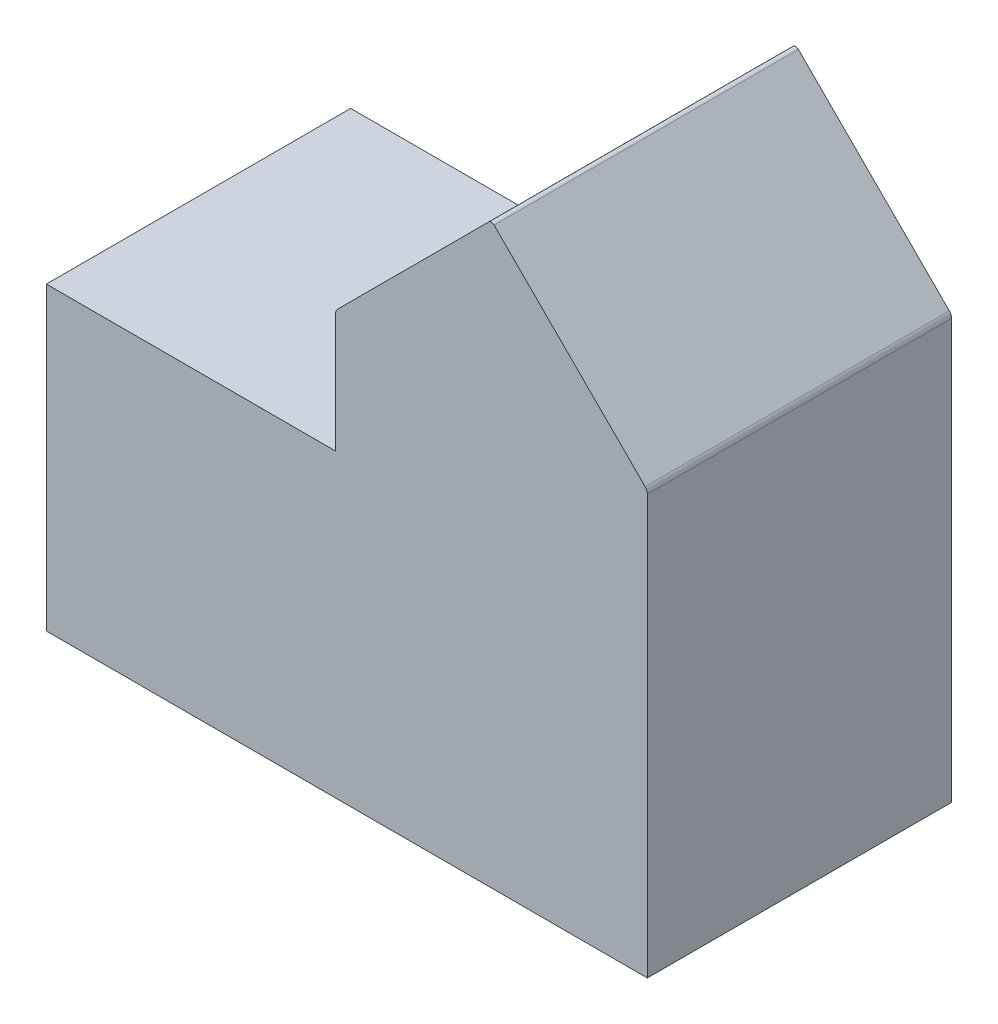
ISO-10303-21;
HEADER;
FILE_DESCRIPTION(('STEP AP214'),'2;1');
FILE_NAME('part.step','',(''),(''),'','','');
FILE_SCHEMA(('AUTOMOTIVE_DESIGN { 1 0 10303 214 1 1 1 1 }'));
ENDSEC;
DATA;
#1=APPLICATION_CONTEXT('core data for automotive mechanical design processes');
#2=APPLICATION_PROTOCOL_DEFINITION('international standard','automotive_design',2000,#1);
#3=PRODUCT_CONTEXT('',#1,'mechanical');
#4=PRODUCT('Part','Part','',(#3));
#5=PRODUCT_RELATED_PRODUCT_CATEGORY('part','',(#4));
#6=PRODUCT_DEFINITION_FORMATION('','',#4);
#7=PRODUCT_DEFINITION_CONTEXT('part definition',#1,'design');
#8=PRODUCT_DEFINITION('design','',#6,#7);
#9=PRODUCT_DEFINITION_SHAPE('','',#8);
#10=(LENGTH_UNIT() NAMED_UNIT(*) SI_UNIT(.MILLI.,.METRE.));
#11=(NAMED_UNIT(*) PLANE_ANGLE_UNIT() SI_UNIT($,.RADIAN.));
#12=(NAMED_UNIT(*) SI_UNIT($,.STERADIAN.) SOLID_ANGLE_UNIT());
#13=UNCERTAINTY_MEASURE_WITH_UNIT(LENGTH_MEASURE(1.E-05),#10,'distance_accuracy_value','');
#14=(GEOMETRIC_REPRESENTATION_CONTEXT(3) GLOBAL_UNCERTAINTY_ASSIGNED_CONTEXT((#13)) GLOBAL_UNIT_ASSIGNED_CONTEXT((#10,
#11,#12)) REPRESENTATION_CONTEXT('',''));
#15=CARTESIAN_POINT('',(0.,0.,0.));
#16=DIRECTION('',(0.,0.,1.));
#17=DIRECTION('',(1.,0.,0.));
#18=AXIS2_PLACEMENT_3D('',#15,#16,#17);
#19=CARTESIAN_POINT('',(-4.73075,4.73074999999998,5.08));
#20=DIRECTION('',(0.707106781186549,-0.707106781186546,0.));
#21=DIRECTION('',(0.707106781186546,0.707106781186549,0.));
#22=AXIS2_PLACEMENT_3D('',#19,#20,#21);
#23=PLANE('',#22);
#24=DIRECTION('',(-0.707106781186546,-0.707106781186549,0.));
#25=VECTOR('',#24,1.);
#26=CARTESIAN_POINT('',(-4.73075,4.73074999999998,5.08));
#27=LINE('',#26,#25);
#28=CARTESIAN_POINT('',(4.73619743878929,14.1976974387893,5.08));
#29=VERTEX_POINT('',#28);
#30=CARTESIAN_POINT('',(-0.306605122421382,9.15489487757861,5.08));
#31=VERTEX_POINT('',#30);
#32=EDGE_CURVE('E132',#29,#31,#27,.T.);
#33=ORIENTED_EDGE('',*,*,#32,.F.);
#34=DIRECTION('',(0.,0.,-1.));
#35=VECTOR('',#34,1.);
#36=CARTESIAN_POINT('',(4.73619743878929,14.1976974387893,5.08));
#37=LINE('',#36,#35);
#38=CARTESIAN_POINT('',(4.73619743878929,14.1976974387893,-5.08));
#39=VERTEX_POINT('',#38);
#40=EDGE_CURVE('E220',#29,#39,#37,.T.);
#41=ORIENTED_EDGE('',*,*,#40,.T.);
#42=DIRECTION('',(-0.707106781186546,-0.707106781186549,0.));
#43=VECTOR('',#42,1.);
#44=CARTESIAN_POINT('',(-4.73075,4.73074999999998,-5.08));
#45=LINE('',#44,#43);
#46=CARTESIAN_POINT('',(-0.306605122421382,9.15489487757861,-5.08));
#47=VERTEX_POINT('',#46);
#48=EDGE_CURVE('E165',#39,#47,#45,.T.);
#49=ORIENTED_EDGE('',*,*,#48,.T.);
#50=DIRECTION('',(0.,0.,-1.));
#51=VECTOR('',#50,1.);
#52=CARTESIAN_POINT('',(-0.306605122421382,9.15489487757861,5.08));
#53=LINE('',#52,#51);
#54=EDGE_CURVE('E204',#47,#31,#53,.F.);
#55=ORIENTED_EDGE('',*,*,#54,.T.);
#56=EDGE_LOOP('',(#33,#41,#49,#55));
#57=FACE_BOUND('',#56,.T.);
#58=ADVANCED_FACE('F41',(#57),#23,.F.);
#59=CARTESIAN_POINT('',(-0.380999999999999,0.,5.08));
#60=DIRECTION('',(1.,0.,0.));
#61=DIRECTION('',(0.,0.,-1.));
#62=AXIS2_PLACEMENT_3D('',#59,#60,#61);
#63=PLANE('',#62);
#64=DIRECTION('',(0.,-1.,0.));
#65=VECTOR('',#64,1.);
#66=CARTESIAN_POINT('',(-0.380999999999999,0.,5.08));
#67=LINE('',#66,#65);
#68=CARTESIAN_POINT('',(-0.380999999999999,8.97528975515723,5.08));
#69=VERTEX_POINT('',#68);
#70=CARTESIAN_POINT('',(-0.380999999999999,5.0165,5.08));
#71=VERTEX_POINT('',#70);
#72=EDGE_CURVE('E119',#69,#71,#67,.T.);
#73=ORIENTED_EDGE('',*,*,#72,.F.);
#74=DIRECTION('',(0.,0.,-1.));
#75=VECTOR('',#74,1.);
#76=CARTESIAN_POINT('',(-0.380999999999999,8.97528975515723,5.08));
#77=LINE('',#76,#75);
#78=CARTESIAN_POINT('',(-0.380999999999999,8.97528975515723,-5.08));
#79=VERTEX_POINT('',#78);
#80=EDGE_CURVE('E143',#69,#79,#77,.T.);
#81=ORIENTED_EDGE('',*,*,#80,.T.);
#82=DIRECTION('',(0.,-1.,0.));
#83=VECTOR('',#82,1.);
#84=CARTESIAN_POINT('',(-0.380999999999999,0.,-5.08));
#85=LINE('',#84,#83);
#86=CARTESIAN_POINT('',(-0.380999999999999,5.0165,-5.08));
#87=VERTEX_POINT('',#86);
#88=EDGE_CURVE('E138',#79,#87,#85,.T.);
#89=ORIENTED_EDGE('',*,*,#88,.T.);
#90=DIRECTION('',(0.,0.,-1.));
#91=VECTOR('',#90,1.);
#92=CARTESIAN_POINT('',(-0.380999999999999,5.0165,5.08));
#93=LINE('',#92,#91);
#94=EDGE_CURVE('E135',#71,#87,#93,.T.);
#95=ORIENTED_EDGE('',*,*,#94,.F.);
#96=EDGE_LOOP('',(#73,#81,#89,#95));
#97=FACE_BOUND('',#96,.T.);
#98=ADVANCED_FACE('F136',(#97),#63,.F.);
#99=CARTESIAN_POINT('',(0.,5.0165,5.08));
#100=DIRECTION('',(0.,1.,0.));
#101=DIRECTION('',(0.,0.,1.));
#102=AXIS2_PLACEMENT_3D('',#99,#100,#101);
#103=PLANE('',#102);
#104=DIRECTION('',(1.,0.,0.));
#105=VECTOR('',#104,1.);
#106=CARTESIAN_POINT('',(0.,5.0165,-5.08));
#107=LINE('',#106,#105);
#108=CARTESIAN_POINT('',(-10.033,5.0165,-5.08));
#109=VERTEX_POINT('',#108);
#110=EDGE_CURVE('E170',#109,#87,#107,.T.);
#111=ORIENTED_EDGE('',*,*,#110,.F.);
#112=DIRECTION('',(0.,0.,-1.));
#113=VECTOR('',#112,1.);
#114=CARTESIAN_POINT('',(-10.033,5.0165,5.08));
#115=LINE('',#114,#113);
#116=CARTESIAN_POINT('',(-10.033,5.0165,5.08));
#117=VERTEX_POINT('',#116);
#118=EDGE_CURVE('E144',#117,#109,#115,.T.);
#119=ORIENTED_EDGE('',*,*,#118,.F.);
#120=DIRECTION('',(1.,0.,0.));
#121=VECTOR('',#120,1.);
#122=CARTESIAN_POINT('',(0.,5.0165,5.08));
#123=LINE('',#122,#121);
#124=EDGE_CURVE('E124',#117,#71,#123,.T.);
#125=ORIENTED_EDGE('',*,*,#124,.T.);
#126=ORIENTED_EDGE('',*,*,#94,.T.);
#127=EDGE_LOOP('',(#111,#119,#125,#126));
#128=FACE_BOUND('',#127,.T.);
#129=ADVANCED_FACE('F146',(#128),#103,.T.);
#130=CARTESIAN_POINT('',(-10.033,0.,5.08));
#131=DIRECTION('',(-1.,0.,0.));
#132=DIRECTION('',(0.,0.,1.));
#133=AXIS2_PLACEMENT_3D('',#130,#131,#132);
#134=PLANE('',#133);
#135=DIRECTION('',(0.,1.,0.));
#136=VECTOR('',#135,1.);
#137=CARTESIAN_POINT('',(-10.033,0.,-5.08));
#138=LINE('',#137,#136);
#139=CARTESIAN_POINT('',(-10.033,-5.0165,-5.08));
#140=VERTEX_POINT('',#139);
#141=EDGE_CURVE('E173',#140,#109,#138,.T.);
#142=ORIENTED_EDGE('',*,*,#141,.F.);
#143=DIRECTION('',(0.,0.,-1.));
#144=VECTOR('',#143,1.);
#145=CARTESIAN_POINT('',(-10.033,-5.0165,5.08));
#146=LINE('',#145,#144);
#147=CARTESIAN_POINT('',(-10.033,-5.0165,5.08));
#148=VERTEX_POINT('',#147);
#149=EDGE_CURVE('E190',#148,#140,#146,.T.);
#150=ORIENTED_EDGE('',*,*,#149,.F.);
#151=DIRECTION('',(0.,1.,0.));
#152=VECTOR('',#151,1.);
#153=CARTESIAN_POINT('',(-10.033,0.,5.08));
#154=LINE('',#153,#152);
#155=EDGE_CURVE('E148',#148,#117,#154,.T.);
#156=ORIENTED_EDGE('',*,*,#155,.T.);
#157=ORIENTED_EDGE('',*,*,#118,.T.);
#158=EDGE_LOOP('',(#142,#150,#156,#157));
#159=FACE_BOUND('',#158,.T.);
#160=ADVANCED_FACE('F253',(#159),#134,.T.);
#161=CARTESIAN_POINT('',(0.,-5.0165,5.08));
#162=DIRECTION('',(0.,1.,0.));
#163=DIRECTION('',(0.,0.,1.));
#164=AXIS2_PLACEMENT_3D('',#161,#162,#163);
#165=PLANE('',#164);
#166=DIRECTION('',(1.,0.,0.));
#167=VECTOR('',#166,1.);
#168=CARTESIAN_POINT('',(0.,-5.0165,-5.08));
#169=LINE('',#168,#167);
#170=CARTESIAN_POINT('',(10.033,-5.0165,-5.08));
#171=VERTEX_POINT('',#170);
#172=EDGE_CURVE('E177',#140,#171,#169,.T.);
#173=ORIENTED_EDGE('',*,*,#172,.T.);
#174=DIRECTION('',(0.,0.,-1.));
#175=VECTOR('',#174,1.);
#176=CARTESIAN_POINT('',(10.033,-5.0165,5.08));
#177=LINE('',#176,#175);
#178=CARTESIAN_POINT('',(10.033,-5.0165,5.08));
#179=VERTEX_POINT('',#178);
#180=EDGE_CURVE('E164',#179,#171,#177,.T.);
#181=ORIENTED_EDGE('',*,*,#180,.F.);
#182=DIRECTION('',(1.,0.,0.));
#183=VECTOR('',#182,1.);
#184=CARTESIAN_POINT('',(0.,-5.0165,5.08));
#185=LINE('',#184,#183);
#186=EDGE_CURVE('E151',#148,#179,#185,.T.);
#187=ORIENTED_EDGE('',*,*,#186,.F.);
#188=ORIENTED_EDGE('',*,*,#149,.T.);
#189=EDGE_LOOP('',(#173,#181,#187,#188));
#190=FACE_BOUND('',#189,.T.);
#191=ADVANCED_FACE('F256',(#190),#165,.F.);
#192=CARTESIAN_POINT('',(10.033,0.,5.08));
#193=DIRECTION('',(-1.,0.,0.));
#194=DIRECTION('',(0.,0.,1.));
#195=AXIS2_PLACEMENT_3D('',#192,#193,#194);
#196=PLANE('',#195);
#197=DIRECTION('',(0.,1.,0.));
#198=VECTOR('',#197,1.);
#199=CARTESIAN_POINT('',(10.033,0.,-5.08));
#200=LINE('',#199,#198);
#201=CARTESIAN_POINT('',(10.033,8.97528975515723,-5.08));
#202=VERTEX_POINT('',#201);
#203=EDGE_CURVE('E180',#171,#202,#200,.T.);
#204=ORIENTED_EDGE('',*,*,#203,.T.);
#205=DIRECTION('',(0.,0.,-1.));
#206=VECTOR('',#205,1.);
#207=CARTESIAN_POINT('',(10.033,8.97528975515723,5.08));
#208=LINE('',#207,#206);
#209=CARTESIAN_POINT('',(10.033,8.97528975515723,5.08));
#210=VERTEX_POINT('',#209);
#211=EDGE_CURVE('E217',#202,#210,#208,.F.);
#212=ORIENTED_EDGE('',*,*,#211,.T.);
#213=DIRECTION('',(0.,1.,0.));
#214=VECTOR('',#213,1.);
#215=CARTESIAN_POINT('',(10.033,0.,5.08));
#216=LINE('',#215,#214);
#217=EDGE_CURVE('E157',#179,#210,#216,.T.);
#218=ORIENTED_EDGE('',*,*,#217,.F.);
#219=ORIENTED_EDGE('',*,*,#180,.T.);
#220=EDGE_LOOP('',(#204,#212,#218,#219));
#221=FACE_BOUND('',#220,.T.);
#222=ADVANCED_FACE('F260',(#221),#196,.F.);
#223=CARTESIAN_POINT('',(9.55674999999998,9.55675000000001,5.08));
#224=DIRECTION('',(-0.707106781186546,-0.707106781186549,0.));
#225=DIRECTION('',(0.707106781186549,-0.707106781186546,0.));
#226=AXIS2_PLACEMENT_3D('',#223,#224,#225);
#227=PLANE('',#226);
#228=DIRECTION('',(-0.707106781186549,0.707106781186546,0.));
#229=VECTOR('',#228,1.);
#230=CARTESIAN_POINT('',(9.55674999999998,9.55675000000001,-5.08));
#231=LINE('',#230,#229);
#232=CARTESIAN_POINT('',(9.95860512242138,9.15489487757861,-5.08));
#233=VERTEX_POINT('',#232);
#234=CARTESIAN_POINT('',(4.91580256121067,14.1976974387893,-5.08));
#235=VERTEX_POINT('',#234);
#236=EDGE_CURVE('E184',#233,#235,#231,.T.);
#237=ORIENTED_EDGE('',*,*,#236,.T.);
#238=DIRECTION('',(0.,0.,-1.));
#239=VECTOR('',#238,1.);
#240=CARTESIAN_POINT('',(4.91580256121067,14.1976974387893,5.08));
#241=LINE('',#240,#239);
#242=CARTESIAN_POINT('',(4.91580256121067,14.1976974387893,5.08));
#243=VERTEX_POINT('',#242);
#244=EDGE_CURVE('E50',#235,#243,#241,.F.);
#245=ORIENTED_EDGE('',*,*,#244,.T.);
#246=DIRECTION('',(-0.707106781186549,0.707106781186546,0.));
#247=VECTOR('',#246,1.);
#248=CARTESIAN_POINT('',(9.55674999999998,9.55675000000001,5.08));
#249=LINE('',#248,#247);
#250=CARTESIAN_POINT('',(9.95860512242138,9.15489487757861,5.08));
#251=VERTEX_POINT('',#250);
#252=EDGE_CURVE('E161',#251,#243,#249,.T.);
#253=ORIENTED_EDGE('',*,*,#252,.F.);
#254=DIRECTION('',(0.,0.,-1.));
#255=VECTOR('',#254,1.);
#256=CARTESIAN_POINT('',(9.95860512242138,9.15489487757861,5.08));
#257=LINE('',#256,#255);
#258=EDGE_CURVE('E213',#251,#233,#257,.T.);
#259=ORIENTED_EDGE('',*,*,#258,.T.);
#260=EDGE_LOOP('',(#237,#245,#253,#259));
#261=FACE_BOUND('',#260,.T.);
#262=ADVANCED_FACE('F264',(#261),#227,.F.);
#263=CARTESIAN_POINT('',(0.,0.,5.08));
#264=DIRECTION('',(0.,0.,1.));
#265=DIRECTION('',(1.,0.,0.));
#266=AXIS2_PLACEMENT_3D('',#263,#264,#265);
#267=PLANE('',#266);
#268=ORIENTED_EDGE('',*,*,#252,.T.);
#269=CARTESIAN_POINT('',(4.82599999999998,14.1078948775786,5.08));
#270=DIRECTION('',(0.,0.,1.));
#271=DIRECTION('',(1.,0.,0.));
#272=AXIS2_PLACEMENT_3D('',#269,#270,#271);
#273=CIRCLE('',#272,0.127);
#274=EDGE_CURVE('E11',#243,#29,#273,.T.);
#275=ORIENTED_EDGE('',*,*,#274,.T.);
#276=ORIENTED_EDGE('',*,*,#32,.T.);
#277=CARTESIAN_POINT('',(-0.126999999999999,8.97528975515723,5.08));
#278=DIRECTION('',(0.,0.,1.));
#279=DIRECTION('',(1.,0.,0.));
#280=AXIS2_PLACEMENT_3D('',#277,#278,#279);
#281=CIRCLE('',#280,0.254);
#282=EDGE_CURVE('E127',#31,#69,#281,.T.);
#283=ORIENTED_EDGE('',*,*,#282,.T.);
#284=ORIENTED_EDGE('',*,*,#72,.T.);
#285=ORIENTED_EDGE('',*,*,#124,.F.);
#286=ORIENTED_EDGE('',*,*,#155,.F.);
#287=ORIENTED_EDGE('',*,*,#186,.T.);
#288=ORIENTED_EDGE('',*,*,#217,.T.);
#289=CARTESIAN_POINT('',(9.779,8.97528975515723,5.08));
#290=DIRECTION('',(0.,0.,1.));
#291=DIRECTION('',(1.,0.,0.));
#292=AXIS2_PLACEMENT_3D('',#289,#290,#291);
#293=CIRCLE('',#292,0.254);
#294=EDGE_CURVE('E208',#210,#251,#293,.T.);
#295=ORIENTED_EDGE('',*,*,#294,.T.);
#296=EDGE_LOOP('',(#268,#275,#276,#283,#284,#285,#286,#287,#288,#295));
#297=FACE_BOUND('',#296,.T.);
#298=ADVANCED_FACE('F121',(#297),#267,.T.);
#299=CARTESIAN_POINT('',(0.,0.,-5.08));
#300=DIRECTION('',(0.,0.,1.));
#301=DIRECTION('',(1.,0.,0.));
#302=AXIS2_PLACEMENT_3D('',#299,#300,#301);
#303=PLANE('',#302);
#304=ORIENTED_EDGE('',*,*,#48,.F.);
#305=CARTESIAN_POINT('',(4.82599999999998,14.1078948775786,-5.08));
#306=DIRECTION('',(0.,0.,1.));
#307=DIRECTION('',(1.,0.,0.));
#308=AXIS2_PLACEMENT_3D('',#305,#306,#307);
#309=CIRCLE('',#308,0.127);
#310=EDGE_CURVE('E64',#39,#235,#309,.F.);
#311=ORIENTED_EDGE('',*,*,#310,.T.);
#312=ORIENTED_EDGE('',*,*,#236,.F.);
#313=CARTESIAN_POINT('',(9.779,8.97528975515723,-5.08));
#314=DIRECTION('',(0.,0.,1.));
#315=DIRECTION('',(1.,0.,0.));
#316=AXIS2_PLACEMENT_3D('',#313,#314,#315);
#317=CIRCLE('',#316,0.254);
#318=EDGE_CURVE('E197',#233,#202,#317,.F.);
#319=ORIENTED_EDGE('',*,*,#318,.T.);
#320=ORIENTED_EDGE('',*,*,#203,.F.);
#321=ORIENTED_EDGE('',*,*,#172,.F.);
#322=ORIENTED_EDGE('',*,*,#141,.T.);
#323=ORIENTED_EDGE('',*,*,#110,.T.);
#324=ORIENTED_EDGE('',*,*,#88,.F.);
#325=CARTESIAN_POINT('',(-0.126999999999999,8.97528975515723,-5.08));
#326=DIRECTION('',(0.,0.,1.));
#327=DIRECTION('',(1.,0.,0.));
#328=AXIS2_PLACEMENT_3D('',#325,#326,#327);
#329=CIRCLE('',#328,0.254);
#330=EDGE_CURVE('E200',#79,#47,#329,.F.);
#331=ORIENTED_EDGE('',*,*,#330,.T.);
#332=EDGE_LOOP('',(#304,#311,#312,#319,#320,#321,#322,#323,#324,#331));
#333=FACE_BOUND('',#332,.T.);
#334=ADVANCED_FACE('F231',(#333),#303,.F.);
#335=CARTESIAN_POINT('',(-0.126999999999999,8.97528975515723,5.08));
#336=DIRECTION('',(0.,0.,-1.));
#337=DIRECTION('',(-1.,0.,0.));
#338=AXIS2_PLACEMENT_3D('',#335,#336,#337);
#339=CYLINDRICAL_SURFACE('',#338,0.254);
#340=ORIENTED_EDGE('',*,*,#282,.F.);
#341=ORIENTED_EDGE('',*,*,#54,.F.);
#342=ORIENTED_EDGE('',*,*,#330,.F.);
#343=ORIENTED_EDGE('',*,*,#80,.F.);
#344=EDGE_LOOP('',(#340,#341,#342,#343));
#345=FACE_BOUND('',#344,.T.);
#346=ADVANCED_FACE('F234',(#345),#339,.T.);
#347=CARTESIAN_POINT('',(9.779,8.97528975515723,5.08));
#348=DIRECTION('',(0.,0.,-1.));
#349=DIRECTION('',(-1.,0.,0.));
#350=AXIS2_PLACEMENT_3D('',#347,#348,#349);
#351=CYLINDRICAL_SURFACE('',#350,0.254);
#352=ORIENTED_EDGE('',*,*,#294,.F.);
#353=ORIENTED_EDGE('',*,*,#211,.F.);
#354=ORIENTED_EDGE('',*,*,#318,.F.);
#355=ORIENTED_EDGE('',*,*,#258,.F.);
#356=EDGE_LOOP('',(#352,#353,#354,#355));
#357=FACE_BOUND('',#356,.T.);
#358=ADVANCED_FACE('F236',(#357),#351,.T.);
#359=CARTESIAN_POINT('',(4.82599999999998,14.1078948775786,5.08));
#360=DIRECTION('',(0.,0.,-1.));
#361=DIRECTION('',(-1.,0.,0.));
#362=AXIS2_PLACEMENT_3D('',#359,#360,#361);
#363=CYLINDRICAL_SURFACE('',#362,0.127);
#364=ORIENTED_EDGE('',*,*,#274,.F.);
#365=ORIENTED_EDGE('',*,*,#244,.F.);
#366=ORIENTED_EDGE('',*,*,#310,.F.);
#367=ORIENTED_EDGE('',*,*,#40,.F.);
#368=EDGE_LOOP('',(#364,#365,#366,#367));
#369=FACE_BOUND('',#368,.T.);
#370=ADVANCED_FACE('F43',(#369),#363,.T.);
#371=CLOSED_SHELL('',(#58,#98,#129,#160,#191,#222,#262,#298,#334,#346,#358,#370));
#372=MANIFOLD_SOLID_BREP('B2',#371);
#373=ADVANCED_BREP_SHAPE_REPRESENTATION('',(#18,#372),#14);
#374=SHAPE_DEFINITION_REPRESENTATION(#9,#373);
ENDSEC;
END-ISO-10303-21;
